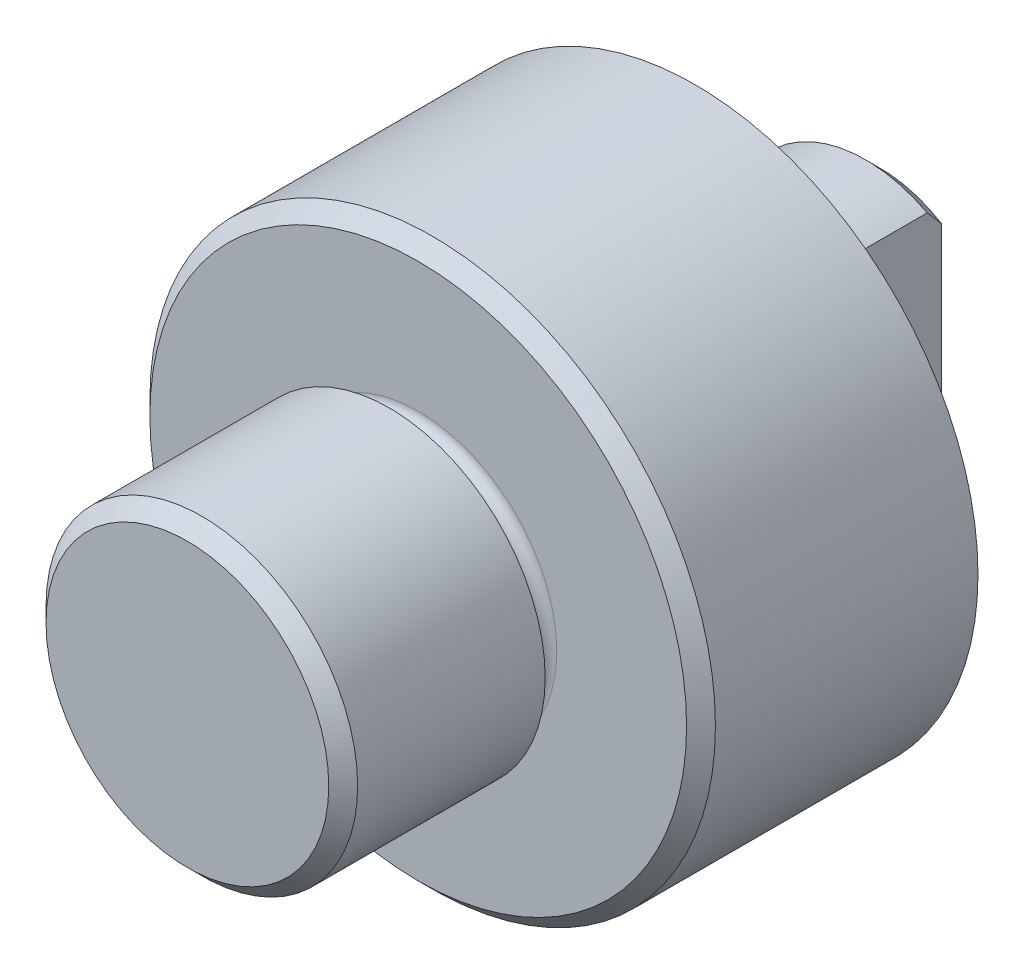
ISO-10303-21;
HEADER;
FILE_DESCRIPTION(('STEP AP214'),'2;1');
FILE_NAME('part.step','',(''),(''),'','','');
FILE_SCHEMA(('AUTOMOTIVE_DESIGN { 1 0 10303 214 1 1 1 1 }'));
ENDSEC;
DATA;
#1=APPLICATION_CONTEXT('core data for automotive mechanical design processes');
#2=APPLICATION_PROTOCOL_DEFINITION('international standard','automotive_design',2000,#1);
#3=PRODUCT_CONTEXT('',#1,'mechanical');
#4=PRODUCT('Part','Part','',(#3));
#5=PRODUCT_RELATED_PRODUCT_CATEGORY('part','',(#4));
#6=PRODUCT_DEFINITION_FORMATION('','',#4);
#7=PRODUCT_DEFINITION_CONTEXT('part definition',#1,'design');
#8=PRODUCT_DEFINITION('design','',#6,#7);
#9=PRODUCT_DEFINITION_SHAPE('','',#8);
#10=(LENGTH_UNIT() NAMED_UNIT(*) SI_UNIT(.MILLI.,.METRE.));
#11=(NAMED_UNIT(*) PLANE_ANGLE_UNIT() SI_UNIT($,.RADIAN.));
#12=(NAMED_UNIT(*) SI_UNIT($,.STERADIAN.) SOLID_ANGLE_UNIT());
#13=UNCERTAINTY_MEASURE_WITH_UNIT(LENGTH_MEASURE(1.E-05),#10,'distance_accuracy_value','');
#14=(GEOMETRIC_REPRESENTATION_CONTEXT(3) GLOBAL_UNCERTAINTY_ASSIGNED_CONTEXT((#13)) GLOBAL_UNIT_ASSIGNED_CONTEXT((#10,
#11,#12)) REPRESENTATION_CONTEXT('',''));
#15=CARTESIAN_POINT('',(0.,0.,0.));
#16=DIRECTION('',(0.,0.,1.));
#17=DIRECTION('',(1.,0.,0.));
#18=AXIS2_PLACEMENT_3D('',#15,#16,#17);
#19=CARTESIAN_POINT('',(0.,0.,127.018539307141));
#20=DIRECTION('',(0.,0.,1.));
#21=DIRECTION('',(1.,0.,0.));
#22=AXIS2_PLACEMENT_3D('',#19,#20,#21);
#23=CYLINDRICAL_SURFACE('',#22,23.);
#24=DIRECTION('',(0.,0.,1.));
#25=VECTOR('',#24,1.);
#26=CARTESIAN_POINT('',(11.3578166916006,-20.,127.018539307141));
#27=LINE('',#26,#25);
#28=CARTESIAN_POINT('',(11.3578166916006,-20.,-18.));
#29=VERTEX_POINT('',#28);
#30=CARTESIAN_POINT('',(11.3578166916005,-20.,-47.5));
#31=VERTEX_POINT('',#30);
#32=EDGE_CURVE('E287',#29,#31,#27,.F.);
#33=ORIENTED_EDGE('',*,*,#32,.F.);
#34=CARTESIAN_POINT('',(0.,0.,-18.));
#35=DIRECTION('',(0.,0.,1.));
#36=DIRECTION('',(1.,0.,0.));
#37=AXIS2_PLACEMENT_3D('',#34,#35,#36);
#38=CIRCLE('',#37,23.);
#39=CARTESIAN_POINT('',(10.7,20.3595186583573,-18.));
#40=VERTEX_POINT('',#39);
#41=EDGE_CURVE('E262',#40,#29,#38,.T.);
#42=ORIENTED_EDGE('',*,*,#41,.F.);
#43=DIRECTION('',(0.,0.,1.));
#44=VECTOR('',#43,1.);
#45=CARTESIAN_POINT('',(10.7,20.3595186583573,127.018539307141));
#46=LINE('',#45,#44);
#47=CARTESIAN_POINT('',(10.7,20.3595186583573,-47.5));
#48=VERTEX_POINT('',#47);
#49=EDGE_CURVE('E289',#48,#40,#46,.T.);
#50=ORIENTED_EDGE('',*,*,#49,.F.);
#51=CARTESIAN_POINT('',(0.,0.,-47.5));
#52=DIRECTION('',(0.,0.,1.));
#53=DIRECTION('',(1.,0.,0.));
#54=AXIS2_PLACEMENT_3D('',#51,#52,#53);
#55=CIRCLE('',#54,23.);
#56=EDGE_CURVE('E245',#48,#31,#55,.T.);
#57=ORIENTED_EDGE('',*,*,#56,.T.);
#58=EDGE_LOOP('',(#33,#42,#50,#57));
#59=FACE_BOUND('',#58,.T.);
#60=ADVANCED_FACE('F43',(#59),#23,.T.);
#61=CARTESIAN_POINT('',(0.,23.,-50.));
#62=DIRECTION('',(0.,0.,1.));
#63=DIRECTION('',(1.,0.,0.));
#64=AXIS2_PLACEMENT_3D('',#61,#62,#63);
#65=PLANE('',#64);
#66=DIRECTION('',(0.,1.,0.));
#67=VECTOR('',#66,1.);
#68=CARTESIAN_POINT('',(10.7,23.,-50.));
#69=LINE('',#68,#67);
#70=CARTESIAN_POINT('',(10.7,-17.4859943955156,-50.));
#71=VERTEX_POINT('',#70);
#72=CARTESIAN_POINT('',(10.7,17.4859943955155,-50.));
#73=VERTEX_POINT('',#72);
#74=EDGE_CURVE('E291',#71,#73,#69,.T.);
#75=ORIENTED_EDGE('',*,*,#74,.F.);
#76=CARTESIAN_POINT('',(0.,0.,-50.));
#77=DIRECTION('',(0.,0.,1.));
#78=DIRECTION('',(1.,0.,0.));
#79=AXIS2_PLACEMENT_3D('',#76,#77,#78);
#80=CIRCLE('',#79,20.5);
#81=EDGE_CURVE('E242',#71,#73,#80,.F.);
#82=ORIENTED_EDGE('',*,*,#81,.T.);
#83=EDGE_LOOP('',(#75,#82));
#84=FACE_BOUND('',#83,.T.);
#85=ADVANCED_FACE('F127',(#84),#65,.F.);
#86=CARTESIAN_POINT('',(0.,0.,-47.5));
#87=DIRECTION('',(0.,0.,1.));
#88=DIRECTION('',(1.,0.,0.));
#89=AXIS2_PLACEMENT_3D('',#86,#87,#88);
#90=CONICAL_SURFACE('',#89,23.,0.78539816339745);
#91=ORIENTED_EDGE('',*,*,#56,.F.);
#92=CARTESIAN_POINT('',(10.7,20.3603094399373,-47.4993));
#93=CARTESIAN_POINT('',(10.7,20.0627833492812,-47.7626622594923));
#94=CARTESIAN_POINT('',(10.7,19.7646451040324,-48.0253347060375));
#95=CARTESIAN_POINT('',(10.7,19.1669755278814,-48.5490973738669));
#96=CARTESIAN_POINT('',(10.7,18.8674441790306,-48.8101875746653));
#97=CARTESIAN_POINT('',(10.7,18.266709262452,-49.330678605176));
#98=CARTESIAN_POINT('',(10.7,17.9655050837331,-49.5900787305462));
#99=CARTESIAN_POINT('',(10.7,17.3613409048574,-50.1068215370982));
#100=CARTESIAN_POINT('',(10.7,17.0583809098697,-50.364164224332));
#101=CARTESIAN_POINT('',(10.7,16.1373009545115,-51.1404651673367));
#102=CARTESIAN_POINT('',(10.7,15.5160863444646,-51.6557771222238));
#103=CARTESIAN_POINT('',(10.7,14.5763580741685,-52.4188756481599));
#104=CARTESIAN_POINT('',(10.7,14.2618284283527,-52.671572932711));
#105=CARTESIAN_POINT('',(10.7,13.6296997780182,-53.1730953850417));
#106=CARTESIAN_POINT('',(10.7,13.3121008238355,-53.4219206161479));
#107=CARTESIAN_POINT('',(10.7,12.6843550534748,-53.9064939080511));
#108=CARTESIAN_POINT('',(10.7,12.3743282409124,-54.1423972265795));
#109=CARTESIAN_POINT('',(10.7,11.7504541723771,-54.6091124756122));
#110=CARTESIAN_POINT('',(10.7,11.4366068833183,-54.8399243619752));
#111=CARTESIAN_POINT('',(10.7,10.8042741981842,-55.2955848563082));
#112=CARTESIAN_POINT('',(10.7,10.4857857579389,-55.5204292497356));
#113=CARTESIAN_POINT('',(10.7,9.84367702955111,-55.9626763128856));
#114=CARTESIAN_POINT('',(10.7,9.5200568408952,-56.1800791266169));
#115=CARTESIAN_POINT('',(10.7,8.86818503603104,-56.6048993697892));
#116=CARTESIAN_POINT('',(10.7,8.53995770341968,-56.8123539209189));
#117=CARTESIAN_POINT('',(10.7,7.87662722658375,-57.2161006885132));
#118=CARTESIAN_POINT('',(10.7,7.54152337110822,-57.4123917423176));
#119=CARTESIAN_POINT('',(10.7,6.86387549017789,-57.7907961237674));
#120=CARTESIAN_POINT('',(10.7,6.52134072205377,-57.9729259266932));
#121=CARTESIAN_POINT('',(10.7,5.82757496231176,-58.3196719726993));
#122=CARTESIAN_POINT('',(10.7,5.47634677123846,-58.4842937676635));
#123=CARTESIAN_POINT('',(10.7,4.78888209933802,-58.7810390492777));
#124=CARTESIAN_POINT('',(10.7,4.45328028249366,-58.9146202452839));
#125=CARTESIAN_POINT('',(10.7,3.77362282918513,-59.1584973937639));
#126=CARTESIAN_POINT('',(10.7,3.42956735320625,-59.2687937878985));
#127=CARTESIAN_POINT('',(10.7,2.73543107605969,-59.4608851262208));
#128=CARTESIAN_POINT('',(10.7,2.38539168760073,-59.5428275037686));
#129=CARTESIAN_POINT('',(10.7,1.67926192661034,-59.6745783219307));
#130=CARTESIAN_POINT('',(10.7,1.32317241733994,-59.7243913080559));
#131=CARTESIAN_POINT('',(10.7,0.603450147983038,-59.7890580378711));
#132=CARTESIAN_POINT('',(10.7,0.239778155747364,-59.8034847393691));
#133=CARTESIAN_POINT('',(10.7,-0.487119911937677,-59.7950859171372));
#134=CARTESIAN_POINT('',(10.7,-0.850345990516378,-59.7722606563471));
#135=CARTESIAN_POINT('',(10.7,-1.57403515450227,-59.6908495626227));
#136=CARTESIAN_POINT('',(10.7,-1.93448336287934,-59.6321338166699));
#137=CARTESIAN_POINT('',(10.7,-2.64859903549498,-59.4826052943884));
#138=CARTESIAN_POINT('',(10.7,-3.0022648112542,-59.3917846321802));
#139=CARTESIAN_POINT('',(10.7,-3.85165482653921,-59.1378896010312));
#140=CARTESIAN_POINT('',(10.7,-4.34310782434704,-58.9605375676865));
#141=CARTESIAN_POINT('',(10.7,-5.06699883575023,-58.6629386133214));
#142=CARTESIAN_POINT('',(10.7,-5.306191426523,-58.5584200478682));
#143=CARTESIAN_POINT('',(10.7,-5.78039560758993,-58.3402851308474));
#144=CARTESIAN_POINT('',(10.7,-6.01540753215045,-58.2266695106695));
#145=CARTESIAN_POINT('',(10.7,-6.48346079826149,-57.9906408360575));
#146=CARTESIAN_POINT('',(10.7,-6.71646823944132,-57.8681610158987));
#147=CARTESIAN_POINT('',(10.7,-7.17877151371956,-57.6163987998264));
#148=CARTESIAN_POINT('',(10.7,-7.40806732767261,-57.4871163688383));
#149=CARTESIAN_POINT('',(10.7,-7.86316755436063,-57.2227597309565));
#150=CARTESIAN_POINT('',(10.7,-8.08897327852046,-57.0876877752327));
#151=CARTESIAN_POINT('',(10.7,-8.53748969491587,-56.812510177399));
#152=CARTESIAN_POINT('',(10.7,-8.760200382241,-56.672404527304));
#153=CARTESIAN_POINT('',(10.7,-9.23364195725089,-56.3680210933807));
#154=CARTESIAN_POINT('',(10.7,-9.48395522959532,-56.2030944789502));
#155=CARTESIAN_POINT('',(10.7,-9.98133810925748,-55.8684136009463));
#156=CARTESIAN_POINT('',(10.7,-10.2284075879252,-55.6986591467393));
#157=CARTESIAN_POINT('',(10.7,-10.9653523680509,-55.1831691000964));
#158=CARTESIAN_POINT('',(10.7,-11.4509032327269,-54.8312463707437));
#159=CARTESIAN_POINT('',(10.7,-12.4133239162581,-54.1147158517049));
#160=CARTESIAN_POINT('',(10.7,-12.890183516532,-53.7500944342696));
#161=CARTESIAN_POINT('',(10.7,-13.8364663213451,-53.0114212016371));
#162=CARTESIAN_POINT('',(10.7,-14.3058900842643,-52.6373701000628));
#163=CARTESIAN_POINT('',(10.7,-15.217261192898,-51.8992743924279));
#164=CARTESIAN_POINT('',(10.7,-15.6594784355859,-51.5355620936499));
#165=CARTESIAN_POINT('',(10.7,-16.5394135721757,-50.8027172188332));
#166=CARTESIAN_POINT('',(10.7,-16.977131338151,-50.4335844894045));
#167=CARTESIAN_POINT('',(10.7,-17.8476319650203,-49.6919229835664));
#168=CARTESIAN_POINT('',(10.7,-18.2804249736071,-49.319406097709));
#169=CARTESIAN_POINT('',(10.7,-19.1428115871934,-48.5707500780912));
#170=CARTESIAN_POINT('',(10.7,-19.5724054291341,-48.1946112174148));
#171=CARTESIAN_POINT('',(10.7,-20.0007,-47.817010768199));
#172=B_SPLINE_CURVE_WITH_KNOTS('',3,(#92,#93,#94,#95,#96,#97,#98,#99,#100,#101,#102,#103,#104,
#105,#106,#107,#108,#109,#110,#111,#112,#113,#114,#115,#116,#117,#118,#119,#120,#121,#122,#123,
#124,#125,#126,#127,#128,#129,#130,#131,#132,#133,#134,#135,#136,#137,#138,#139,#140,#141,#142,
#143,#144,#145,#146,#147,#148,#149,#150,#151,#152,#153,#154,#155,#156,#157,#158,#159,#160,#161,
#162,#163,#164,#165,#166,#167,#168,#169,#170,#171),.UNSPECIFIED.,.F.,.F.,(4,2,2,2,2,2,2,2,2,2,2,
2,2,2,2,2,2,2,2,2,2,2,2,2,2,2,2,2,2,2,2,2,2,2,2,2,2,2,2,4),(0.,1.19202946668675,2.3840743340937,
3.57658773443205,4.76909762568433,7.19031660505482,8.40069172927408,9.61104703719551,
10.7797221720063,11.9484074349304,13.1178972284692,14.2873643773663,15.4520600582653,
16.6168768190355,17.7803174925358,18.943388125725,20.0263148778653,21.1092210874519,
22.1864087365476,23.2634439568986,24.3534142707593,25.4433768911905,26.5373084136016,
27.6315088235936,29.1959694341813,29.9789431101665,30.7618538993086,31.5514418200782,
32.3410338124131,33.1303215205661,33.9196104808292,34.8188298068843,35.7180846892154,
37.5168118726329,39.3175327627141,41.1181177838981,42.8357937694081,44.5535184565699,
46.2665956501571,47.9795446797163),.UNSPECIFIED.);
#173=EDGE_CURVE('E205',#48,#73,#172,.T.);
#174=ORIENTED_EDGE('',*,*,#173,.T.);
#175=ORIENTED_EDGE('',*,*,#81,.F.);
#176=CARTESIAN_POINT('',(10.7,-20.,-47.8176279900007));
#177=VERTEX_POINT('',#176);
#178=EDGE_CURVE('E206',#71,#177,#172,.T.);
#179=ORIENTED_EDGE('',*,*,#178,.T.);
#180=CARTESIAN_POINT('',(-1.85169393498639,-20.,-50.4144636509536));
#181=CARTESIAN_POINT('',(-1.60177585444145,-20.,-50.4375193572189));
#182=CARTESIAN_POINT('',(-1.35142938392893,-20.,-50.4559588878899));
#183=CARTESIAN_POINT('',(-0.850223525557511,-20.,-50.483495989334));
#184=CARTESIAN_POINT('',(-0.599364137254113,-20.,-50.4925935520077));
#185=CARTESIAN_POINT('',(-0.0976557936254374,-20.,-50.5013339490562));
#186=CARTESIAN_POINT('',(0.153193041428964,-20.,-50.5009835249313));
#187=CARTESIAN_POINT('',(0.654686600549238,-20.,-50.4908589379309));
#188=CARTESIAN_POINT('',(0.905331325891931,-20.,-50.481084834466));
#189=CARTESIAN_POINT('',(1.64774407671556,-20.,-50.4382422969251));
#190=CARTESIAN_POINT('',(2.13880080687572,-20.,-50.3917969306738));
#191=CARTESIAN_POINT('',(3.1164371378675,-20.,-50.2644609803916));
#192=CARTESIAN_POINT('',(3.60301585521848,-20.,-50.1835637420247));
#193=CARTESIAN_POINT('',(4.47767073000149,-20.,-50.0084785738576));
#194=CARTESIAN_POINT('',(4.86685584337186,-20.,-49.9197571432707));
#195=CARTESIAN_POINT('',(5.64039185929147,-20.,-49.7232331210737));
#196=CARTESIAN_POINT('',(6.02474208185695,-20.,-49.6154278769337));
#197=CARTESIAN_POINT('',(7.17027377416083,-20.,-49.2659769044311));
#198=CARTESIAN_POINT('',(7.92364072730968,-20.,-48.9983576212336));
#199=CARTESIAN_POINT('',(9.04323002532395,-20.,-48.5532479163188));
#200=CARTESIAN_POINT('',(9.41783195828648,-20.,-48.3960642286022));
#201=CARTESIAN_POINT('',(10.1615342384418,-20.,-48.0691001854689));
#202=CARTESIAN_POINT('',(10.5306345455887,-20.,-47.8993197384152));
#203=CARTESIAN_POINT('',(11.2633880981464,-20.,-47.5487382309178));
#204=CARTESIAN_POINT('',(11.6270430577889,-20.,-47.3679407336121));
#205=CARTESIAN_POINT('',(12.349334010472,-20.,-46.9965936064518));
#206=CARTESIAN_POINT('',(12.7079699556996,-20.,-46.8060438837744));
#207=CARTESIAN_POINT('',(13.4415764504921,-20.,-46.4048520923153));
#208=CARTESIAN_POINT('',(13.8162610097469,-20.,-46.1936880006656));
#209=CARTESIAN_POINT('',(14.5607516877447,-20.,-45.7629143841432));
#210=CARTESIAN_POINT('',(14.9305575786876,-20.,-45.5433044667701));
#211=CARTESIAN_POINT('',(16.0333502978066,-20.,-44.8733225009838));
#212=CARTESIAN_POINT('',(16.7596083419942,-20.,-44.4118557385637));
#213=CARTESIAN_POINT('',(18.1979614270266,-20.,-43.4653460987894));
#214=CARTESIAN_POINT('',(18.9100347300314,-20.,-42.9802704517647));
#215=CARTESIAN_POINT('',(20.3213818501429,-20.,-41.9920216987173));
#216=CARTESIAN_POINT('',(21.0206567666977,-20.,-41.4888501583414));
#217=CARTESIAN_POINT('',(22.3712375648981,-20.,-40.4954245172603));
#218=CARTESIAN_POINT('',(23.0231026697674,-20.,-40.0059280770108));
#219=CARTESIAN_POINT('',(24.318711412099,-20.,-39.016274603827));
#220=CARTESIAN_POINT('',(24.9624547580878,-20.,-38.5161171900149));
#221=CARTESIAN_POINT('',(26.2406706985416,-20.,-37.5088102494522));
#222=CARTESIAN_POINT('',(26.8751683892121,-20.,-37.0016925239223));
#223=CARTESIAN_POINT('',(27.8224237412702,-20.,-36.2355452127974));
#224=CARTESIAN_POINT('',(28.1374106376426,-20.,-35.9792645356184));
#225=CARTESIAN_POINT('',(28.7660000657237,-20.,-35.4650157162895));
#226=CARTESIAN_POINT('',(29.0796026081106,-20.,-35.2070475871938));
#227=CARTESIAN_POINT('',(29.3925660949661,-20.,-34.9483060650136));
#228=B_SPLINE_CURVE_WITH_KNOTS('',3,(#180,#181,#182,#183,#184,#185,#186,#187,#188,#189,#190,
#191,#192,#193,#194,#195,#196,#197,#198,#199,#200,#201,#202,#203,#204,#205,#206,#207,#208,#209,
#210,#211,#212,#213,#214,#215,#216,#217,#218,#219,#220,#221,#222,#223,#224,#225,#226,#227),
.UNSPECIFIED.,.F.,.F.,(4,2,2,2,2,2,2,2,2,2,2,2,2,2,2,2,2,2,2,2,2,2,2,4),(0.,0.752898329999305,
1.50579731274024,2.25815908744628,3.01051611899178,4.4888624747755,5.96749450091213,
7.16448596064327,8.36164392546213,10.7568620647375,11.975444601914,13.1940360047253,
14.4122353608599,15.6304463141174,16.9205935662296,18.210800847589,20.7915711896029,
23.3760319728476,25.9602696853921,28.4057127059465,30.8512432402607,33.2879358184703,
34.5061546839151,35.7243641362467),.UNSPECIFIED.);
#229=EDGE_CURVE('E196',#177,#31,#228,.T.);
#230=ORIENTED_EDGE('',*,*,#229,.T.);
#231=EDGE_LOOP('',(#91,#174,#175,#179,#230));
#232=FACE_BOUND('',#231,.T.);
#233=ADVANCED_FACE('F133',(#232),#90,.T.);
#234=CARTESIAN_POINT('',(0.,0.,70.));
#235=DIRECTION('',(0.,0.,-1.));
#236=DIRECTION('',(-1.,0.,0.));
#237=AXIS2_PLACEMENT_3D('',#234,#235,#236);
#238=PLANE('',#237);
#239=CARTESIAN_POINT('',(0.,0.,70.));
#240=DIRECTION('',(0.,0.,-1.));
#241=DIRECTION('',(-1.,0.,0.));
#242=AXIS2_PLACEMENT_3D('',#239,#240,#241);
#243=CIRCLE('',#242,24.5);
#244=CARTESIAN_POINT('',(-24.5,0.,70.));
#245=VERTEX_POINT('',#244);
#246=EDGE_CURVE('E253',#245,#245,#243,.F.);
#247=ORIENTED_EDGE('',*,*,#246,.T.);
#248=EDGE_LOOP('',(#247));
#249=FACE_BOUND('',#248,.T.);
#250=ADVANCED_FACE('F222',(#249),#238,.F.);
#251=CARTESIAN_POINT('',(0.,0.,127.018539307141));
#252=DIRECTION('',(0.,0.,1.));
#253=DIRECTION('',(1.,0.,0.));
#254=AXIS2_PLACEMENT_3D('',#251,#252,#253);
#255=CYLINDRICAL_SURFACE('',#254,27.);
#256=CARTESIAN_POINT('',(0.,0.,67.5));
#257=DIRECTION('',(0.,0.,-1.));
#258=DIRECTION('',(-1.,0.,0.));
#259=AXIS2_PLACEMENT_3D('',#256,#257,#258);
#260=CIRCLE('',#259,27.);
#261=CARTESIAN_POINT('',(-27.,0.,67.5));
#262=VERTEX_POINT('',#261);
#263=EDGE_CURVE('E250',#262,#262,#260,.T.);
#264=ORIENTED_EDGE('',*,*,#263,.T.);
#265=EDGE_LOOP('',(#264));
#266=FACE_BOUND('',#265,.T.);
#267=CARTESIAN_POINT('',(0.,0.,35.));
#268=DIRECTION('',(0.,0.,1.));
#269=DIRECTION('',(1.,0.,0.));
#270=AXIS2_PLACEMENT_3D('',#267,#268,#269);
#271=CIRCLE('',#270,27.);
#272=CARTESIAN_POINT('',(27.,0.,35.));
#273=VERTEX_POINT('',#272);
#274=EDGE_CURVE('E256',#273,#273,#271,.T.);
#275=ORIENTED_EDGE('',*,*,#274,.T.);
#276=EDGE_LOOP('',(#275));
#277=FACE_BOUND('',#276,.T.);
#278=ADVANCED_FACE('F337',(#266,#277),#255,.T.);
#279=CARTESIAN_POINT('',(0.,22.,35.));
#280=DIRECTION('',(0.,0.,1.));
#281=DIRECTION('',(1.,0.,0.));
#282=AXIS2_PLACEMENT_3D('',#279,#280,#281);
#283=PLANE('',#282);
#284=CARTESIAN_POINT('',(0.,0.,35.));
#285=DIRECTION('',(0.,0.,1.));
#286=DIRECTION('',(1.,0.,0.));
#287=AXIS2_PLACEMENT_3D('',#284,#285,#286);
#288=CIRCLE('',#287,24.);
#289=CARTESIAN_POINT('',(24.,0.,35.));
#290=VERTEX_POINT('',#289);
#291=EDGE_CURVE('E211',#290,#290,#288,.T.);
#292=ORIENTED_EDGE('',*,*,#291,.T.);
#293=EDGE_LOOP('',(#292));
#294=FACE_BOUND('',#293,.T.);
#295=ORIENTED_EDGE('',*,*,#274,.F.);
#296=EDGE_LOOP('',(#295));
#297=FACE_BOUND('',#296,.T.);
#298=ADVANCED_FACE('F331',(#294,#297),#283,.F.);
#299=CARTESIAN_POINT('',(0.,0.,127.018539307141));
#300=DIRECTION('',(0.,0.,1.));
#301=DIRECTION('',(1.,0.,0.));
#302=AXIS2_PLACEMENT_3D('',#299,#300,#301);
#303=CYLINDRICAL_SURFACE('',#302,22.);
#304=CARTESIAN_POINT('',(0.,0.,33.));
#305=DIRECTION('',(0.,0.,1.));
#306=DIRECTION('',(1.,0.,0.));
#307=AXIS2_PLACEMENT_3D('',#304,#305,#306);
#308=CIRCLE('',#307,22.);
#309=CARTESIAN_POINT('',(22.,0.,33.));
#310=VERTEX_POINT('',#309);
#311=EDGE_CURVE('E51',#310,#310,#308,.F.);
#312=ORIENTED_EDGE('',*,*,#311,.T.);
#313=EDGE_LOOP('',(#312));
#314=FACE_BOUND('',#313,.T.);
#315=CARTESIAN_POINT('',(0.,0.,32.));
#316=DIRECTION('',(0.,0.,-1.));
#317=DIRECTION('',(-1.,0.,0.));
#318=AXIS2_PLACEMENT_3D('',#315,#316,#317);
#319=CIRCLE('',#318,22.);
#320=CARTESIAN_POINT('',(-22.,0.,32.));
#321=VERTEX_POINT('',#320);
#322=EDGE_CURVE('E319',#321,#321,#319,.F.);
#323=ORIENTED_EDGE('',*,*,#322,.T.);
#324=EDGE_LOOP('',(#323));
#325=FACE_BOUND('',#324,.T.);
#326=ADVANCED_FACE('F328',(#314,#325),#303,.T.);
#327=CARTESIAN_POINT('',(0.,22.,30.));
#328=DIRECTION('',(0.,0.,-1.));
#329=DIRECTION('',(-1.,0.,0.));
#330=AXIS2_PLACEMENT_3D('',#327,#328,#329);
#331=PLANE('',#330);
#332=CARTESIAN_POINT('',(0.,0.,30.));
#333=DIRECTION('',(0.,0.,-1.));
#334=DIRECTION('',(-1.,0.,0.));
#335=AXIS2_PLACEMENT_3D('',#332,#333,#334);
#336=CIRCLE('',#335,24.);
#337=CARTESIAN_POINT('',(-24.,0.,30.));
#338=VERTEX_POINT('',#337);
#339=EDGE_CURVE('E12',#338,#338,#336,.T.);
#340=ORIENTED_EDGE('',*,*,#339,.T.);
#341=EDGE_LOOP('',(#340));
#342=FACE_BOUND('',#341,.T.);
#343=CARTESIAN_POINT('',(0.,0.,30.));
#344=DIRECTION('',(0.,0.,-1.));
#345=DIRECTION('',(-1.,0.,0.));
#346=AXIS2_PLACEMENT_3D('',#343,#344,#345);
#347=CIRCLE('',#346,46.5);
#348=CARTESIAN_POINT('',(-46.5,0.,30.));
#349=VERTEX_POINT('',#348);
#350=EDGE_CURVE('E240',#349,#349,#347,.F.);
#351=ORIENTED_EDGE('',*,*,#350,.T.);
#352=EDGE_LOOP('',(#351));
#353=FACE_BOUND('',#352,.T.);
#354=ADVANCED_FACE('F148',(#342,#353),#331,.F.);
#355=CARTESIAN_POINT('',(0.,0.,127.018539307141));
#356=DIRECTION('',(0.,0.,1.));
#357=DIRECTION('',(1.,0.,0.));
#358=AXIS2_PLACEMENT_3D('',#355,#356,#357);
#359=CYLINDRICAL_SURFACE('',#358,49.);
#360=DIRECTION('',(0.,0.,1.));
#361=VECTOR('',#360,1.);
#362=CARTESIAN_POINT('',(4.,-48.8364617882991,127.018539307141));
#363=LINE('',#362,#361);
#364=CARTESIAN_POINT('',(4.,-48.8364617882991,18.));
#365=VERTEX_POINT('',#364);
#366=CARTESIAN_POINT('',(4.,-48.8364617882991,-9.99999999999999));
#367=VERTEX_POINT('',#366);
#368=EDGE_CURVE('E316',#365,#367,#363,.F.);
#369=ORIENTED_EDGE('',*,*,#368,.T.);
#370=CARTESIAN_POINT('',(4.,-48.8364617882991,-9.99999999999999));
#371=CARTESIAN_POINT('',(4.00001099609929,-48.8364579945532,-10.1123043955185));
#372=CARTESIAN_POINT('',(3.99527045092115,-48.8368490915555,-10.2246034250355));
#373=CARTESIAN_POINT('',(3.97637141055848,-48.8383930430441,-10.448394372141));
#374=CARTESIAN_POINT('',(3.96221348261674,-48.8395458516499,-10.559886337933));
#375=CARTESIAN_POINT('',(3.92458059374045,-48.8425839328078,-10.7811875624726));
#376=CARTESIAN_POINT('',(3.90111346468486,-48.8444685896243,-10.8909981553181));
#377=CARTESIAN_POINT('',(3.84505544165668,-48.8489133115001,-11.1082185098003));
#378=CARTESIAN_POINT('',(3.81246463460837,-48.8514733701246,-11.2156282942998));
#379=CARTESIAN_POINT('',(3.70128088961253,-48.8600668863422,-11.5332059974193));
#380=CARTESIAN_POINT('',(3.60925830648656,-48.8670152575358,-11.7388293890791));
#381=CARTESIAN_POINT('',(3.39217222948319,-48.8825625956402,-12.1315672868132));
#382=CARTESIAN_POINT('',(3.26711355197168,-48.8911613218942,-12.3186844854634));
#383=CARTESIAN_POINT('',(2.98714919102124,-48.9090646359628,-12.6697218358666));
#384=CARTESIAN_POINT('',(2.83218140053417,-48.918370667706,-12.8335924651198));
#385=CARTESIAN_POINT('',(2.49691862738258,-48.9366276352769,-13.1330391555908));
#386=CARTESIAN_POINT('',(2.3166197952407,-48.9455785168678,-13.2686109085206));
#387=CARTESIAN_POINT('',(1.93552094384083,-48.9621295507357,-13.5077671221157));
#388=CARTESIAN_POINT('',(1.73469333103019,-48.9697278463439,-13.6113077558685));
#389=CARTESIAN_POINT('',(1.31844378008847,-48.9827011883804,-13.7831735498804));
#390=CARTESIAN_POINT('',(1.10302297681802,-48.988076407459,-13.8515014449603));
#391=CARTESIAN_POINT('',(0.664200021590616,-48.9959882317779,-13.9508650631994));
#392=CARTESIAN_POINT('',(0.440816730775874,-48.9985311377112,-13.9819835728245));
#393=CARTESIAN_POINT('',(-0.00802135074469155,-49.0005131849716,-14.0063008587046));
#394=CARTESIAN_POINT('',(-0.233476155181359,-48.9999523057107,-13.9994993834291));
#395=CARTESIAN_POINT('',(-0.679483693053343,-48.9957950740554,-13.9482364322045));
#396=CARTESIAN_POINT('',(-0.900046862855672,-48.9922059861907,-13.9038650837073));
#397=CARTESIAN_POINT('',(-1.33058361981965,-48.982404437404,-13.7788614928254));
#398=CARTESIAN_POINT('',(-1.54055715993506,-48.9761919648283,-13.6982290893605));
#399=CARTESIAN_POINT('',(-1.94424539744658,-48.9618300251568,-13.5028924358422));
#400=CARTESIAN_POINT('',(-2.13794011768578,-48.9536782237904,-13.3881470839092));
#401=CARTESIAN_POINT('',(-2.50334814897396,-48.936354176148,-13.1278672827371));
#402=CARTESIAN_POINT('',(-2.67506204368661,-48.9271819569795,-12.982333651301));
#403=CARTESIAN_POINT('',(-2.9921343195915,-48.9088179913587,-12.6641595917961));
#404=CARTESIAN_POINT('',(-3.13741794919832,-48.8996262616876,-12.4914447811918));
#405=CARTESIAN_POINT('',(-3.39702397339594,-48.8822793692189,-12.1238633036566));
#406=CARTESIAN_POINT('',(-3.51133681259875,-48.874124526742,-11.9289898264012));
#407=CARTESIAN_POINT('',(-3.6570328130806,-48.8633651940209,-11.6244557798291));
#408=CARTESIAN_POINT('',(-3.70133075237623,-48.8600219011259,-11.5208086010998));
#409=CARTESIAN_POINT('',(-3.78102923850113,-48.8539192176435,-11.3101433561393));
#410=CARTESIAN_POINT('',(-3.81643314805636,-48.8511596064355,-11.2031265811861));
#411=CARTESIAN_POINT('',(-3.87805128704417,-48.8463066313372,-10.9866015469376));
#412=CARTESIAN_POINT('',(-3.90427548348435,-48.8442125450725,-10.8770961282105));
#413=CARTESIAN_POINT('',(-3.94739384407629,-48.8407468333844,-10.6562951391967));
#414=CARTESIAN_POINT('',(-3.96429256200608,-48.8393748553594,-10.5450004700028));
#415=CARTESIAN_POINT('',(-3.98431437258643,-48.837744617342,-10.3612269248743));
#416=CARTESIAN_POINT('',(-3.99020011381622,-48.8372637368905,-10.2890393551419));
#417=CARTESIAN_POINT('',(-3.99804015715765,-48.8366223200821,-10.1445703583879));
#418=CARTESIAN_POINT('',(-4.00000099714829,-48.8364612510051,-10.0722892884726));
#419=CARTESIAN_POINT('',(-4.,-48.8364617882991,-9.99999999999999));
#420=B_SPLINE_CURVE_WITH_KNOTS('',3,(#370,#371,#372,#373,#374,#375,#376,#377,#378,#379,#380,
#381,#382,#383,#384,#385,#386,#387,#388,#389,#390,#391,#392,#393,#394,#395,#396,#397,#398,#399,
#400,#401,#402,#403,#404,#405,#406,#407,#408,#409,#410,#411,#412,#413,#414,#415,#416,#417,#418,
#419),.UNSPECIFIED.,.F.,.F.,(4,2,2,2,2,2,2,2,2,2,2,2,2,2,2,2,2,2,2,2,2,2,2,2,4),(0.,
0.336802872077834,0.673585459145283,1.01008530815077,1.34658195132,2.01925327355504,
2.69182658042464,3.36581182891864,4.03989961180485,4.71490568409909,5.38985932369396,
6.06330846064552,6.73676206471979,7.40860466388452,8.08045024756201,8.75310862555298,
9.4257491385313,10.1002634387518,10.7749856098397,11.112953871836,11.4507941591169,
11.7882664852281,12.1255738721348,12.3427607308915,12.5595855099615),.UNSPECIFIED.);
#421=CARTESIAN_POINT('',(-4.,-48.8364617882991,-9.99999999999999));
#422=VERTEX_POINT('',#421);
#423=EDGE_CURVE('E153',#367,#422,#420,.T.);
#424=ORIENTED_EDGE('',*,*,#423,.T.);
#425=DIRECTION('',(0.,0.,1.));
#426=VECTOR('',#425,1.);
#427=CARTESIAN_POINT('',(-4.,-48.8364617882991,127.018539307141));
#428=LINE('',#427,#426);
#429=CARTESIAN_POINT('',(-4.,-48.8364617882991,18.));
#430=VERTEX_POINT('',#429);
#431=EDGE_CURVE('E166',#422,#430,#428,.T.);
#432=ORIENTED_EDGE('',*,*,#431,.T.);
#433=CARTESIAN_POINT('',(-4.,-48.8364617882991,18.));
#434=CARTESIAN_POINT('',(-4.00001099609929,-48.8364579945532,18.1123043955185));
#435=CARTESIAN_POINT('',(-3.99527045092115,-48.8368490915555,18.2246034250356));
#436=CARTESIAN_POINT('',(-3.97637141055847,-48.8383930430441,18.4483943721411));
#437=CARTESIAN_POINT('',(-3.96221348261674,-48.8395458516499,18.559886337933));
#438=CARTESIAN_POINT('',(-3.92458059374045,-48.8425839328078,18.7811875624726));
#439=CARTESIAN_POINT('',(-3.90111346468486,-48.8444685896243,18.8909981553181));
#440=CARTESIAN_POINT('',(-3.84505544165667,-48.8489133115001,19.1082185098003));
#441=CARTESIAN_POINT('',(-3.81246463460837,-48.8514733701246,19.2156282942998));
#442=CARTESIAN_POINT('',(-3.70128088961253,-48.8600668863422,19.5332059974193));
#443=CARTESIAN_POINT('',(-3.60925830648655,-48.8670152575358,19.7388293890791));
#444=CARTESIAN_POINT('',(-3.39217222948319,-48.8825625956402,20.1315672868133));
#445=CARTESIAN_POINT('',(-3.26711355197167,-48.8911613218942,20.3186844854634));
#446=CARTESIAN_POINT('',(-2.98714919102123,-48.9090646359628,20.6697218358666));
#447=CARTESIAN_POINT('',(-2.83218140053417,-48.918370667706,20.8335924651198));
#448=CARTESIAN_POINT('',(-2.49691862738258,-48.9366276352769,21.1330391555908));
#449=CARTESIAN_POINT('',(-2.31661979524069,-48.9455785168678,21.2686109085206));
#450=CARTESIAN_POINT('',(-1.93552094384083,-48.9621295507357,21.5077671221157));
#451=CARTESIAN_POINT('',(-1.73469333103019,-48.9697278463439,21.6113077558685));
#452=CARTESIAN_POINT('',(-1.31844378008847,-48.9827011883804,21.7831735498805));
#453=CARTESIAN_POINT('',(-1.10302297681802,-48.988076407459,21.8515014449603));
#454=CARTESIAN_POINT('',(-0.664200021590616,-48.9959882317779,21.9508650631994));
#455=CARTESIAN_POINT('',(-0.440816730775873,-48.9985311377112,21.9819835728245));
#456=CARTESIAN_POINT('',(0.00802135074469282,-49.0005131849716,22.0063008587046));
#457=CARTESIAN_POINT('',(0.233476155181361,-48.9999523057107,21.9994993834291));
#458=CARTESIAN_POINT('',(0.679483693053344,-48.9957950740554,21.9482364322045));
#459=CARTESIAN_POINT('',(0.900046862855673,-48.9922059861907,21.9038650837073));
#460=CARTESIAN_POINT('',(1.33058361981965,-48.982404437404,21.7788614928254));
#461=CARTESIAN_POINT('',(1.54055715993506,-48.9761919648283,21.6982290893605));
#462=CARTESIAN_POINT('',(1.94424539744658,-48.9618300251568,21.5028924358422));
#463=CARTESIAN_POINT('',(2.13794011768578,-48.9536782237904,21.3881470839092));
#464=CARTESIAN_POINT('',(2.50334814897396,-48.936354176148,21.1278672827371));
#465=CARTESIAN_POINT('',(2.67506204368661,-48.9271819569795,20.982333651301));
#466=CARTESIAN_POINT('',(2.9921343195915,-48.9088179913587,20.6641595917961));
#467=CARTESIAN_POINT('',(3.13741794919832,-48.8996262616876,20.4914447811918));
#468=CARTESIAN_POINT('',(3.39702397339594,-48.8822793692189,20.1238633036566));
#469=CARTESIAN_POINT('',(3.51133681259875,-48.874124526742,19.9289898264013));
#470=CARTESIAN_POINT('',(3.6570328130806,-48.8633651940209,19.6244557798291));
#471=CARTESIAN_POINT('',(3.70133075237623,-48.8600219011259,19.5208086010998));
#472=CARTESIAN_POINT('',(3.78102923850114,-48.8539192176435,19.3101433561393));
#473=CARTESIAN_POINT('',(3.81643314805636,-48.8511596064355,19.2031265811861));
#474=CARTESIAN_POINT('',(3.87805128704418,-48.8463066313372,18.9866015469377));
#475=CARTESIAN_POINT('',(3.90427548348436,-48.8442125450725,18.8770961282105));
#476=CARTESIAN_POINT('',(3.94739384407629,-48.8407468333844,18.6562951391968));
#477=CARTESIAN_POINT('',(3.96429256200609,-48.8393748553594,18.5450004700028));
#478=CARTESIAN_POINT('',(3.98431437258643,-48.837744617342,18.3612269248743));
#479=CARTESIAN_POINT('',(3.99020011381622,-48.8372637368905,18.2890393551419));
#480=CARTESIAN_POINT('',(3.99804015715765,-48.8366223200821,18.1445703583879));
#481=CARTESIAN_POINT('',(4.0000009971483,-48.8364612510051,18.0722892884726));
#482=CARTESIAN_POINT('',(4.,-48.8364617882991,18.));
#483=B_SPLINE_CURVE_WITH_KNOTS('',3,(#433,#434,#435,#436,#437,#438,#439,#440,#441,#442,#443,
#444,#445,#446,#447,#448,#449,#450,#451,#452,#453,#454,#455,#456,#457,#458,#459,#460,#461,#462,
#463,#464,#465,#466,#467,#468,#469,#470,#471,#472,#473,#474,#475,#476,#477,#478,#479,#480,#481,
#482),.UNSPECIFIED.,.F.,.F.,(4,2,2,2,2,2,2,2,2,2,2,2,2,2,2,2,2,2,2,2,2,2,2,2,4),(0.,
0.336802872077835,0.673585459145289,1.01008530815077,1.34658195132,2.01925327355504,
2.69182658042464,3.36581182891864,4.03989961180486,4.71490568409909,5.38985932369396,
6.06330846064552,6.73676206471979,7.40860466388452,8.08045024756201,8.75310862555298,
9.4257491385313,10.1002634387518,10.7749856098397,11.112953871836,11.4507941591169,
11.7882664852281,12.1255738721348,12.3427607308915,12.5595855099615),.UNSPECIFIED.);
#484=EDGE_CURVE('E66',#430,#365,#483,.T.);
#485=ORIENTED_EDGE('',*,*,#484,.T.);
#486=EDGE_LOOP('',(#369,#424,#432,#485));
#487=FACE_BOUND('',#486,.T.);
#488=CARTESIAN_POINT('',(0.,0.,27.5));
#489=DIRECTION('',(0.,0.,-1.));
#490=DIRECTION('',(-1.,0.,0.));
#491=AXIS2_PLACEMENT_3D('',#488,#489,#490);
#492=CIRCLE('',#491,49.);
#493=CARTESIAN_POINT('',(-49.,0.,27.5));
#494=VERTEX_POINT('',#493);
#495=EDGE_CURVE('E237',#494,#494,#492,.T.);
#496=ORIENTED_EDGE('',*,*,#495,.T.);
#497=EDGE_LOOP('',(#496));
#498=FACE_BOUND('',#497,.T.);
#499=CARTESIAN_POINT('',(0.,0.,-18.));
#500=DIRECTION('',(0.,0.,1.));
#501=DIRECTION('',(1.,0.,0.));
#502=AXIS2_PLACEMENT_3D('',#499,#500,#501);
#503=CIRCLE('',#502,49.);
#504=CARTESIAN_POINT('',(49.,0.,-18.));
#505=VERTEX_POINT('',#504);
#506=EDGE_CURVE('E259',#505,#505,#503,.T.);
#507=ORIENTED_EDGE('',*,*,#506,.T.);
#508=EDGE_LOOP('',(#507));
#509=FACE_BOUND('',#508,.T.);
#510=ADVANCED_FACE('F143',(#487,#498,#509),#359,.T.);
#511=CARTESIAN_POINT('',(0.,49.,-18.));
#512=DIRECTION('',(0.,0.,1.));
#513=DIRECTION('',(1.,0.,0.));
#514=AXIS2_PLACEMENT_3D('',#511,#512,#513);
#515=PLANE('',#514);
#516=ORIENTED_EDGE('',*,*,#41,.T.);
#517=DIRECTION('',(-1.,0.,0.));
#518=VECTOR('',#517,1.);
#519=CARTESIAN_POINT('',(23.,-20.,-18.));
#520=LINE('',#519,#518);
#521=CARTESIAN_POINT('',(10.7,-20.,-18.));
#522=VERTEX_POINT('',#521);
#523=EDGE_CURVE('E293',#29,#522,#520,.T.);
#524=ORIENTED_EDGE('',*,*,#523,.T.);
#525=DIRECTION('',(0.,-1.,0.));
#526=VECTOR('',#525,1.);
#527=CARTESIAN_POINT('',(10.7,23.,-18.));
#528=LINE('',#527,#526);
#529=EDGE_CURVE('E296',#40,#522,#528,.T.);
#530=ORIENTED_EDGE('',*,*,#529,.F.);
#531=EDGE_LOOP('',(#516,#524,#530));
#532=FACE_BOUND('',#531,.T.);
#533=ORIENTED_EDGE('',*,*,#506,.F.);
#534=EDGE_LOOP('',(#533));
#535=FACE_BOUND('',#534,.T.);
#536=ADVANCED_FACE('F139',(#532,#535),#515,.F.);
#537=CARTESIAN_POINT('',(0.,0.,70.));
#538=DIRECTION('',(0.,0.,-1.));
#539=DIRECTION('',(-1.,0.,0.));
#540=AXIS2_PLACEMENT_3D('',#537,#538,#539);
#541=CONICAL_SURFACE('',#540,24.5,0.78539816339745);
#542=ORIENTED_EDGE('',*,*,#263,.F.);
#543=EDGE_LOOP('',(#542));
#544=FACE_BOUND('',#543,.T.);
#545=ORIENTED_EDGE('',*,*,#246,.F.);
#546=EDGE_LOOP('',(#545));
#547=FACE_BOUND('',#546,.T.);
#548=ADVANCED_FACE('F142',(#544,#547),#541,.T.);
#549=CARTESIAN_POINT('',(0.,0.,30.));
#550=DIRECTION('',(0.,0.,-1.));
#551=DIRECTION('',(-1.,0.,0.));
#552=AXIS2_PLACEMENT_3D('',#549,#550,#551);
#553=CONICAL_SURFACE('',#552,46.5,0.785398163397443);
#554=ORIENTED_EDGE('',*,*,#495,.F.);
#555=EDGE_LOOP('',(#554));
#556=FACE_BOUND('',#555,.T.);
#557=ORIENTED_EDGE('',*,*,#350,.F.);
#558=EDGE_LOOP('',(#557));
#559=FACE_BOUND('',#558,.T.);
#560=ADVANCED_FACE('F173',(#556,#559),#553,.T.);
#561=CARTESIAN_POINT('',(0.,-43.5,18.));
#562=DIRECTION('',(0.,-1.,0.));
#563=DIRECTION('',(1.,0.,0.));
#564=AXIS2_PLACEMENT_3D('',#561,#562,#563);
#565=CYLINDRICAL_SURFACE('',#564,4.);
#566=DIRECTION('',(0.,-1.,0.));
#567=VECTOR('',#566,1.);
#568=CARTESIAN_POINT('',(-3.99999999999996,-43.5,18.));
#569=LINE('',#568,#567);
#570=CARTESIAN_POINT('',(-3.99999999999996,-43.5,18.));
#571=VERTEX_POINT('',#570);
#572=EDGE_CURVE('E266',#571,#430,#569,.T.);
#573=ORIENTED_EDGE('',*,*,#572,.F.);
#574=CARTESIAN_POINT('',(0.,-43.5,18.));
#575=DIRECTION('',(0.,-1.,0.));
#576=DIRECTION('',(1.,0.,0.));
#577=AXIS2_PLACEMENT_3D('',#574,#575,#576);
#578=CIRCLE('',#577,4.);
#579=CARTESIAN_POINT('',(4.00000000000004,-43.5,18.));
#580=VERTEX_POINT('',#579);
#581=EDGE_CURVE('E284',#580,#571,#578,.T.);
#582=ORIENTED_EDGE('',*,*,#581,.F.);
#583=DIRECTION('',(0.,-1.,0.));
#584=VECTOR('',#583,1.);
#585=CARTESIAN_POINT('',(4.00000000000004,-43.5,18.));
#586=LINE('',#585,#584);
#587=EDGE_CURVE('E265',#580,#365,#586,.T.);
#588=ORIENTED_EDGE('',*,*,#587,.T.);
#589=ORIENTED_EDGE('',*,*,#484,.F.);
#590=EDGE_LOOP('',(#573,#582,#588,#589));
#591=FACE_BOUND('',#590,.T.);
#592=ADVANCED_FACE('F168',(#591),#565,.F.);
#593=CARTESIAN_POINT('',(4.00000000000004,-43.5,18.));
#594=DIRECTION('',(1.,0.,0.));
#595=DIRECTION('',(0.,1.,0.));
#596=AXIS2_PLACEMENT_3D('',#593,#594,#595);
#597=PLANE('',#596);
#598=ORIENTED_EDGE('',*,*,#587,.F.);
#599=DIRECTION('',(0.,0.,1.));
#600=VECTOR('',#599,1.);
#601=CARTESIAN_POINT('',(4.00000000000004,-43.5,18.));
#602=LINE('',#601,#600);
#603=CARTESIAN_POINT('',(4.00000000000004,-43.5,-9.99999999999999));
#604=VERTEX_POINT('',#603);
#605=EDGE_CURVE('E269',#604,#580,#602,.T.);
#606=ORIENTED_EDGE('',*,*,#605,.F.);
#607=DIRECTION('',(0.,-1.,0.));
#608=VECTOR('',#607,1.);
#609=CARTESIAN_POINT('',(4.00000000000004,-43.5,-9.99999999999999));
#610=LINE('',#609,#608);
#611=EDGE_CURVE('E272',#604,#367,#610,.T.);
#612=ORIENTED_EDGE('',*,*,#611,.T.);
#613=ORIENTED_EDGE('',*,*,#368,.F.);
#614=EDGE_LOOP('',(#598,#606,#612,#613));
#615=FACE_BOUND('',#614,.T.);
#616=ADVANCED_FACE('F172',(#615),#597,.F.);
#617=CARTESIAN_POINT('',(0.,-43.5,-9.99999999999999));
#618=DIRECTION('',(0.,-1.,0.));
#619=DIRECTION('',(1.,0.,0.));
#620=AXIS2_PLACEMENT_3D('',#617,#618,#619);
#621=CYLINDRICAL_SURFACE('',#620,4.);
#622=ORIENTED_EDGE('',*,*,#611,.F.);
#623=CARTESIAN_POINT('',(0.,-43.5,-9.99999999999999));
#624=DIRECTION('',(0.,-1.,0.));
#625=DIRECTION('',(1.,0.,0.));
#626=AXIS2_PLACEMENT_3D('',#623,#624,#625);
#627=CIRCLE('',#626,4.);
#628=CARTESIAN_POINT('',(-3.99999999999996,-43.5,-9.99999999999999));
#629=VERTEX_POINT('',#628);
#630=EDGE_CURVE('E278',#629,#604,#627,.T.);
#631=ORIENTED_EDGE('',*,*,#630,.F.);
#632=DIRECTION('',(0.,-1.,0.));
#633=VECTOR('',#632,1.);
#634=CARTESIAN_POINT('',(-3.99999999999996,-43.5,-9.99999999999999));
#635=LINE('',#634,#633);
#636=EDGE_CURVE('E268',#629,#422,#635,.T.);
#637=ORIENTED_EDGE('',*,*,#636,.T.);
#638=ORIENTED_EDGE('',*,*,#423,.F.);
#639=EDGE_LOOP('',(#622,#631,#637,#638));
#640=FACE_BOUND('',#639,.T.);
#641=ADVANCED_FACE('F177',(#640),#621,.F.);
#642=CARTESIAN_POINT('',(-3.99999999999996,-43.5,18.));
#643=DIRECTION('',(-1.,0.,0.));
#644=DIRECTION('',(0.,-1.,0.));
#645=AXIS2_PLACEMENT_3D('',#642,#643,#644);
#646=PLANE('',#645);
#647=ORIENTED_EDGE('',*,*,#636,.F.);
#648=DIRECTION('',(0.,0.,-1.));
#649=VECTOR('',#648,1.);
#650=CARTESIAN_POINT('',(-3.99999999999996,-43.5,18.));
#651=LINE('',#650,#649);
#652=EDGE_CURVE('E281',#571,#629,#651,.T.);
#653=ORIENTED_EDGE('',*,*,#652,.F.);
#654=ORIENTED_EDGE('',*,*,#572,.T.);
#655=ORIENTED_EDGE('',*,*,#431,.F.);
#656=EDGE_LOOP('',(#647,#653,#654,#655));
#657=FACE_BOUND('',#656,.T.);
#658=ADVANCED_FACE('F174',(#657),#646,.F.);
#659=CARTESIAN_POINT('',(0.,-43.5,18.));
#660=DIRECTION('',(0.,-1.,0.));
#661=DIRECTION('',(1.,0.,0.));
#662=AXIS2_PLACEMENT_3D('',#659,#660,#661);
#663=PLANE('',#662);
#664=ORIENTED_EDGE('',*,*,#581,.T.);
#665=ORIENTED_EDGE('',*,*,#652,.T.);
#666=ORIENTED_EDGE('',*,*,#630,.T.);
#667=ORIENTED_EDGE('',*,*,#605,.T.);
#668=EDGE_LOOP('',(#664,#665,#666,#667));
#669=FACE_BOUND('',#668,.T.);
#670=ADVANCED_FACE('F176',(#669),#663,.T.);
#671=CARTESIAN_POINT('',(23.,-20.,-18.));
#672=DIRECTION('',(0.,1.,0.));
#673=DIRECTION('',(0.,0.,1.));
#674=AXIS2_PLACEMENT_3D('',#671,#672,#673);
#675=PLANE('',#674);
#676=ORIENTED_EDGE('',*,*,#32,.T.);
#677=ORIENTED_EDGE('',*,*,#229,.F.);
#678=DIRECTION('',(0.,0.,-1.));
#679=VECTOR('',#678,1.);
#680=CARTESIAN_POINT('',(10.7,-20.,-18.));
#681=LINE('',#680,#679);
#682=EDGE_CURVE('E58',#522,#177,#681,.T.);
#683=ORIENTED_EDGE('',*,*,#682,.F.);
#684=ORIENTED_EDGE('',*,*,#523,.F.);
#685=EDGE_LOOP('',(#676,#677,#683,#684));
#686=FACE_BOUND('',#685,.T.);
#687=ADVANCED_FACE('F188',(#686),#675,.T.);
#688=CARTESIAN_POINT('',(10.7,0.,0.));
#689=DIRECTION('',(1.,0.,0.));
#690=DIRECTION('',(0.,0.,-1.));
#691=AXIS2_PLACEMENT_3D('',#688,#689,#690);
#692=PLANE('',#691);
#693=CARTESIAN_POINT('',(10.7,0.,-33.));
#694=DIRECTION('',(1.,0.,0.));
#695=DIRECTION('',(0.,0.,-1.));
#696=AXIS2_PLACEMENT_3D('',#693,#694,#695);
#697=CIRCLE('',#696,5.99999999999999);
#698=CARTESIAN_POINT('',(10.7,0.,-39.));
#699=VERTEX_POINT('',#698);
#700=EDGE_CURVE('E298',#699,#699,#697,.T.);
#701=ORIENTED_EDGE('',*,*,#700,.F.);
#702=EDGE_LOOP('',(#701));
#703=FACE_BOUND('',#702,.T.);
#704=ORIENTED_EDGE('',*,*,#49,.T.);
#705=ORIENTED_EDGE('',*,*,#529,.T.);
#706=ORIENTED_EDGE('',*,*,#682,.T.);
#707=ORIENTED_EDGE('',*,*,#178,.F.);
#708=ORIENTED_EDGE('',*,*,#74,.T.);
#709=ORIENTED_EDGE('',*,*,#173,.F.);
#710=EDGE_LOOP('',(#704,#705,#706,#707,#708,#709));
#711=FACE_BOUND('',#710,.T.);
#712=ADVANCED_FACE('F122',(#703,#711),#692,.T.);
#713=CARTESIAN_POINT('',(2.3,0.,-33.));
#714=DIRECTION('',(1.,0.,0.));
#715=DIRECTION('',(0.,0.,-1.));
#716=AXIS2_PLACEMENT_3D('',#713,#714,#715);
#717=CYLINDRICAL_SURFACE('',#716,5.99999999999999);
#718=CARTESIAN_POINT('',(2.3,0.,-33.));
#719=DIRECTION('',(1.,0.,0.));
#720=DIRECTION('',(0.,0.,-1.));
#721=AXIS2_PLACEMENT_3D('',#718,#719,#720);
#722=CIRCLE('',#721,5.99999999999999);
#723=CARTESIAN_POINT('',(2.3,0.,-39.));
#724=VERTEX_POINT('',#723);
#725=EDGE_CURVE('E301',#724,#724,#722,.T.);
#726=ORIENTED_EDGE('',*,*,#725,.F.);
#727=EDGE_LOOP('',(#726));
#728=FACE_BOUND('',#727,.T.);
#729=ORIENTED_EDGE('',*,*,#700,.T.);
#730=EDGE_LOOP('',(#729));
#731=FACE_BOUND('',#730,.T.);
#732=ADVANCED_FACE('F114',(#728,#731),#717,.F.);
#733=CARTESIAN_POINT('',(0.,0.,-33.));
#734=DIRECTION('',(1.,0.,0.));
#735=DIRECTION('',(0.,0.,-1.));
#736=AXIS2_PLACEMENT_3D('',#733,#734,#735);
#737=CONICAL_SURFACE('',#736,0.,1.20473981094748);
#738=ORIENTED_EDGE('',*,*,#725,.T.);
#739=EDGE_LOOP('',(#738));
#740=FACE_BOUND('',#739,.T.);
#741=CARTESIAN_POINT('',(0.,0.,-33.));
#742=VERTEX_POINT('',#741);
#743=VERTEX_LOOP('',#742);
#744=FACE_BOUND('',#743,.T.);
#745=ADVANCED_FACE('F111',(#740,#744),#737,.F.);
#746=CARTESIAN_POINT('',(0.,0.,33.));
#747=DIRECTION('',(0.,0.,1.));
#748=DIRECTION('',(1.,0.,0.));
#749=AXIS2_PLACEMENT_3D('',#746,#747,#748);
#750=TOROIDAL_SURFACE('',#749,24.,2.);
#751=ORIENTED_EDGE('',*,*,#311,.F.);
#752=EDGE_LOOP('',(#751));
#753=FACE_BOUND('',#752,.T.);
#754=ORIENTED_EDGE('',*,*,#291,.F.);
#755=EDGE_LOOP('',(#754));
#756=FACE_BOUND('',#755,.T.);
#757=ADVANCED_FACE('F113',(#753,#756),#750,.F.);
#758=CARTESIAN_POINT('',(0.,0.,32.));
#759=DIRECTION('',(0.,0.,-1.));
#760=DIRECTION('',(-1.,0.,0.));
#761=AXIS2_PLACEMENT_3D('',#758,#759,#760);
#762=TOROIDAL_SURFACE('',#761,24.,2.);
#763=ORIENTED_EDGE('',*,*,#339,.F.);
#764=EDGE_LOOP('',(#763));
#765=FACE_BOUND('',#764,.T.);
#766=ORIENTED_EDGE('',*,*,#322,.F.);
#767=EDGE_LOOP('',(#766));
#768=FACE_BOUND('',#767,.T.);
#769=ADVANCED_FACE('F45',(#765,#768),#762,.F.);
#770=CLOSED_SHELL('',(#60,#85,#233,#250,#278,#298,#326,#354,#510,#536,#548,#560,#592,#616,#641,
#658,#670,#687,#712,#732,#745,#757,#769));
#771=MANIFOLD_SOLID_BREP('B2',#770);
#772=ADVANCED_BREP_SHAPE_REPRESENTATION('',(#18,#771),#14);
#773=SHAPE_DEFINITION_REPRESENTATION(#9,#772);
ENDSEC;
END-ISO-10303-21;
